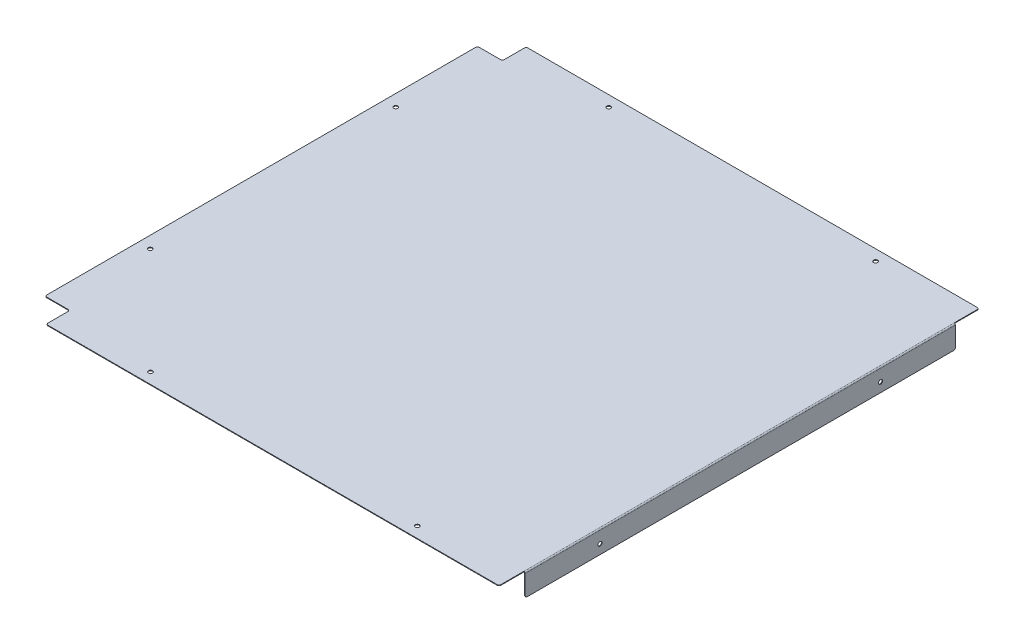
ISO-10303-21;
HEADER;
FILE_DESCRIPTION(('STEP AP214'),'2;1');
FILE_NAME('part.step','',(''),(''),'','','');
FILE_SCHEMA(('AUTOMOTIVE_DESIGN { 1 0 10303 214 1 1 1 1 }'));
ENDSEC;
DATA;
#1=APPLICATION_CONTEXT('core data for automotive mechanical design processes');
#2=APPLICATION_PROTOCOL_DEFINITION('international standard','automotive_design',2000,#1);
#3=PRODUCT_CONTEXT('',#1,'mechanical');
#4=PRODUCT('Part','Part','',(#3));
#5=PRODUCT_RELATED_PRODUCT_CATEGORY('part','',(#4));
#6=PRODUCT_DEFINITION_FORMATION('','',#4);
#7=PRODUCT_DEFINITION_CONTEXT('part definition',#1,'design');
#8=PRODUCT_DEFINITION('design','',#6,#7);
#9=PRODUCT_DEFINITION_SHAPE('','',#8);
#10=(LENGTH_UNIT() NAMED_UNIT(*) SI_UNIT(.MILLI.,.METRE.));
#11=(NAMED_UNIT(*) PLANE_ANGLE_UNIT() SI_UNIT($,.RADIAN.));
#12=(NAMED_UNIT(*) SI_UNIT($,.STERADIAN.) SOLID_ANGLE_UNIT());
#13=UNCERTAINTY_MEASURE_WITH_UNIT(LENGTH_MEASURE(1.E-05),#10,'distance_accuracy_value','');
#14=(GEOMETRIC_REPRESENTATION_CONTEXT(3) GLOBAL_UNCERTAINTY_ASSIGNED_CONTEXT((#13)) GLOBAL_UNIT_ASSIGNED_CONTEXT((#10,
#11,#12)) REPRESENTATION_CONTEXT('',''));
#15=CARTESIAN_POINT('',(0.,0.,0.));
#16=DIRECTION('',(0.,0.,1.));
#17=DIRECTION('',(1.,0.,0.));
#18=AXIS2_PLACEMENT_3D('',#15,#16,#17);
#19=CARTESIAN_POINT('',(362.5,0.,-403.582250064176));
#20=DIRECTION('',(-1.,0.,0.));
#21=DIRECTION('',(0.,0.,1.));
#22=AXIS2_PLACEMENT_3D('',#19,#20,#21);
#23=PLANE('',#22);
#24=DIRECTION('',(0.,0.,1.));
#25=VECTOR('',#24,1.);
#26=CARTESIAN_POINT('',(362.5,0.,0.));
#27=LINE('',#26,#25);
#28=CARTESIAN_POINT('',(362.5,0.,-382.));
#29=VERTEX_POINT('',#28);
#30=CARTESIAN_POINT('',(362.5,0.,-345.));
#31=VERTEX_POINT('',#30);
#32=EDGE_CURVE('E365',#29,#31,#27,.T.);
#33=ORIENTED_EDGE('',*,*,#32,.F.);
#34=DIRECTION('',(0.,-1.,0.));
#35=VECTOR('',#34,1.);
#36=CARTESIAN_POINT('',(362.5,1.,-382.));
#37=LINE('',#36,#35);
#38=CARTESIAN_POINT('',(362.5,1.,-382.));
#39=VERTEX_POINT('',#38);
#40=EDGE_CURVE('E384',#29,#39,#37,.F.);
#41=ORIENTED_EDGE('',*,*,#40,.T.);
#42=DIRECTION('',(0.,0.,1.));
#43=VECTOR('',#42,1.);
#44=CARTESIAN_POINT('',(362.5,1.,-403.582250064176));
#45=LINE('',#44,#43);
#46=CARTESIAN_POINT('',(362.5,1.00000000000001,-345.));
#47=VERTEX_POINT('',#46);
#48=EDGE_CURVE('E286',#39,#47,#45,.T.);
#49=ORIENTED_EDGE('',*,*,#48,.T.);
#50=DIRECTION('',(0.,1.,0.));
#51=VECTOR('',#50,1.);
#52=CARTESIAN_POINT('',(362.5,0.,-345.));
#53=LINE('',#52,#51);
#54=EDGE_CURVE('E281',#31,#47,#53,.T.);
#55=ORIENTED_EDGE('',*,*,#54,.F.);
#56=EDGE_LOOP('',(#33,#41,#49,#55));
#57=FACE_BOUND('',#56,.T.);
#58=ADVANCED_FACE('F59',(#57),#23,.F.);
#59=CARTESIAN_POINT('',(0.,1.,-385.));
#60=DIRECTION('',(0.,0.,1.));
#61=DIRECTION('',(1.,0.,0.));
#62=AXIS2_PLACEMENT_3D('',#59,#60,#61);
#63=PLANE('',#62);
#64=DIRECTION('',(1.,0.,0.));
#65=VECTOR('',#64,1.);
#66=CARTESIAN_POINT('',(0.,1.,-385.));
#67=LINE('',#66,#65);
#68=CARTESIAN_POINT('',(-361.,1.,-385.));
#69=VERTEX_POINT('',#68);
#70=CARTESIAN_POINT('',(359.5,1.,-385.));
#71=VERTEX_POINT('',#70);
#72=EDGE_CURVE('E314',#69,#71,#67,.T.);
#73=ORIENTED_EDGE('',*,*,#72,.T.);
#74=DIRECTION('',(0.,1.,0.));
#75=VECTOR('',#74,1.);
#76=CARTESIAN_POINT('',(359.5,0.,-385.));
#77=LINE('',#76,#75);
#78=CARTESIAN_POINT('',(359.5,0.,-385.));
#79=VERTEX_POINT('',#78);
#80=EDGE_CURVE('E402',#71,#79,#77,.F.);
#81=ORIENTED_EDGE('',*,*,#80,.T.);
#82=DIRECTION('',(1.,0.,0.));
#83=VECTOR('',#82,1.);
#84=CARTESIAN_POINT('',(0.,0.,-385.));
#85=LINE('',#84,#83);
#86=CARTESIAN_POINT('',(-361.,0.,-385.));
#87=VERTEX_POINT('',#86);
#88=EDGE_CURVE('E360',#87,#79,#85,.T.);
#89=ORIENTED_EDGE('',*,*,#88,.F.);
#90=DIRECTION('',(0.,1.,0.));
#91=VECTOR('',#90,1.);
#92=CARTESIAN_POINT('',(-361.,1.,-385.));
#93=LINE('',#92,#91);
#94=EDGE_CURVE('E399',#87,#69,#93,.T.);
#95=ORIENTED_EDGE('',*,*,#94,.T.);
#96=EDGE_LOOP('',(#73,#81,#89,#95));
#97=FACE_BOUND('',#96,.T.);
#98=ADVANCED_FACE('F499',(#97),#63,.F.);
#99=CARTESIAN_POINT('',(-364.,1.,5.3008102957558E-13));
#100=DIRECTION('',(-1.,0.,0.));
#101=DIRECTION('',(0.,0.,1.));
#102=AXIS2_PLACEMENT_3D('',#99,#100,#101);
#103=PLANE('',#102);
#104=DIRECTION('',(0.,0.,1.));
#105=VECTOR('',#104,1.);
#106=CARTESIAN_POINT('',(-364.,1.,5.3008102957558E-13));
#107=LINE('',#106,#105);
#108=CARTESIAN_POINT('',(-364.,1.,-382.));
#109=VERTEX_POINT('',#108);
#110=CARTESIAN_POINT('',(-364.,1.,-349.881188118812));
#111=VERTEX_POINT('',#110);
#112=EDGE_CURVE('E317',#109,#111,#107,.T.);
#113=ORIENTED_EDGE('',*,*,#112,.F.);
#114=DIRECTION('',(0.,-1.,0.));
#115=VECTOR('',#114,1.);
#116=CARTESIAN_POINT('',(-364.,1.,-382.));
#117=LINE('',#116,#115);
#118=CARTESIAN_POINT('',(-364.,0.,-382.));
#119=VERTEX_POINT('',#118);
#120=EDGE_CURVE('E82',#109,#119,#117,.T.);
#121=ORIENTED_EDGE('',*,*,#120,.T.);
#122=DIRECTION('',(0.,0.,1.));
#123=VECTOR('',#122,1.);
#124=CARTESIAN_POINT('',(-364.,0.,0.));
#125=LINE('',#124,#123);
#126=CARTESIAN_POINT('',(-364.,0.,-349.881188118812));
#127=VERTEX_POINT('',#126);
#128=EDGE_CURVE('E358',#119,#127,#125,.T.);
#129=ORIENTED_EDGE('',*,*,#128,.T.);
#130=DIRECTION('',(0.,-1.,0.));
#131=VECTOR('',#130,1.);
#132=CARTESIAN_POINT('',(-364.,1.,-349.881188118812));
#133=LINE('',#132,#131);
#134=EDGE_CURVE('E416',#127,#111,#133,.F.);
#135=ORIENTED_EDGE('',*,*,#134,.T.);
#136=EDGE_LOOP('',(#113,#121,#129,#135));
#137=FACE_BOUND('',#136,.T.);
#138=ADVANCED_FACE('F491',(#137),#103,.T.);
#139=CARTESIAN_POINT('',(0.,1.,-346.881188118812));
#140=DIRECTION('',(0.,0.,1.));
#141=DIRECTION('',(1.,0.,0.));
#142=AXIS2_PLACEMENT_3D('',#139,#140,#141);
#143=PLANE('',#142);
#144=DIRECTION('',(1.,0.,0.));
#145=VECTOR('',#144,1.);
#146=CARTESIAN_POINT('',(0.,1.,-346.881188118812));
#147=LINE('',#146,#145);
#148=CARTESIAN_POINT('',(-401.,1.,-346.881188118812));
#149=VERTEX_POINT('',#148);
#150=CARTESIAN_POINT('',(-367.,1.,-346.881188118812));
#151=VERTEX_POINT('',#150);
#152=EDGE_CURVE('E320',#149,#151,#147,.T.);
#153=ORIENTED_EDGE('',*,*,#152,.T.);
#154=DIRECTION('',(0.,1.,0.));
#155=VECTOR('',#154,1.);
#156=CARTESIAN_POINT('',(-367.,0.,-346.881188118812));
#157=LINE('',#156,#155);
#158=CARTESIAN_POINT('',(-367.,0.,-346.881188118812));
#159=VERTEX_POINT('',#158);
#160=EDGE_CURVE('E423',#151,#159,#157,.F.);
#161=ORIENTED_EDGE('',*,*,#160,.T.);
#162=DIRECTION('',(1.,0.,0.));
#163=VECTOR('',#162,1.);
#164=CARTESIAN_POINT('',(0.,0.,-346.881188118812));
#165=LINE('',#164,#163);
#166=CARTESIAN_POINT('',(-401.,0.,-346.881188118812));
#167=VERTEX_POINT('',#166);
#168=EDGE_CURVE('E356',#167,#159,#165,.T.);
#169=ORIENTED_EDGE('',*,*,#168,.F.);
#170=DIRECTION('',(0.,-1.,0.));
#171=VECTOR('',#170,1.);
#172=CARTESIAN_POINT('',(-401.,1.,-346.881188118812));
#173=LINE('',#172,#171);
#174=EDGE_CURVE('E420',#167,#149,#173,.F.);
#175=ORIENTED_EDGE('',*,*,#174,.T.);
#176=EDGE_LOOP('',(#153,#161,#169,#175));
#177=FACE_BOUND('',#176,.T.);
#178=ADVANCED_FACE('F485',(#177),#143,.F.);
#179=CARTESIAN_POINT('',(-404.,1.,0.));
#180=DIRECTION('',(1.,0.,0.));
#181=DIRECTION('',(0.,0.,-1.));
#182=AXIS2_PLACEMENT_3D('',#179,#180,#181);
#183=PLANE('',#182);
#184=DIRECTION('',(0.,0.,-1.));
#185=VECTOR('',#184,1.);
#186=CARTESIAN_POINT('',(-404.,1.,0.));
#187=LINE('',#186,#185);
#188=CARTESIAN_POINT('',(-404.,1.,343.881188118812));
#189=VERTEX_POINT('',#188);
#190=CARTESIAN_POINT('',(-404.,1.,-343.881188118812));
#191=VERTEX_POINT('',#190);
#192=EDGE_CURVE('E323',#189,#191,#187,.T.);
#193=ORIENTED_EDGE('',*,*,#192,.T.);
#194=DIRECTION('',(0.,-1.,0.));
#195=VECTOR('',#194,1.);
#196=CARTESIAN_POINT('',(-404.,1.,-343.881188118812));
#197=LINE('',#196,#195);
#198=CARTESIAN_POINT('',(-404.,0.,-343.881188118812));
#199=VERTEX_POINT('',#198);
#200=EDGE_CURVE('E428',#191,#199,#197,.T.);
#201=ORIENTED_EDGE('',*,*,#200,.T.);
#202=DIRECTION('',(0.,0.,1.));
#203=VECTOR('',#202,1.);
#204=CARTESIAN_POINT('',(-404.,0.,0.));
#205=LINE('',#204,#203);
#206=CARTESIAN_POINT('',(-404.,0.,343.881188118812));
#207=VERTEX_POINT('',#206);
#208=EDGE_CURVE('E353',#207,#199,#205,.F.);
#209=ORIENTED_EDGE('',*,*,#208,.F.);
#210=DIRECTION('',(0.,1.,0.));
#211=VECTOR('',#210,1.);
#212=CARTESIAN_POINT('',(-404.,1.,343.881188118812));
#213=LINE('',#212,#211);
#214=EDGE_CURVE('E425',#207,#189,#213,.T.);
#215=ORIENTED_EDGE('',*,*,#214,.T.);
#216=EDGE_LOOP('',(#193,#201,#209,#215));
#217=FACE_BOUND('',#216,.T.);
#218=ADVANCED_FACE('F477',(#217),#183,.F.);
#219=CARTESIAN_POINT('',(0.,1.,346.881188118812));
#220=DIRECTION('',(0.,0.,1.));
#221=DIRECTION('',(1.,0.,0.));
#222=AXIS2_PLACEMENT_3D('',#219,#220,#221);
#223=PLANE('',#222);
#224=DIRECTION('',(1.,0.,0.));
#225=VECTOR('',#224,1.);
#226=CARTESIAN_POINT('',(0.,1.,346.881188118812));
#227=LINE('',#226,#225);
#228=CARTESIAN_POINT('',(-401.,1.,346.881188118812));
#229=VERTEX_POINT('',#228);
#230=CARTESIAN_POINT('',(-367.,1.,346.881188118812));
#231=VERTEX_POINT('',#230);
#232=EDGE_CURVE('E326',#229,#231,#227,.T.);
#233=ORIENTED_EDGE('',*,*,#232,.F.);
#234=DIRECTION('',(0.,-1.,0.));
#235=VECTOR('',#234,1.);
#236=CARTESIAN_POINT('',(-401.,1.,346.881188118812));
#237=LINE('',#236,#235);
#238=CARTESIAN_POINT('',(-401.,0.,346.881188118812));
#239=VERTEX_POINT('',#238);
#240=EDGE_CURVE('E433',#229,#239,#237,.T.);
#241=ORIENTED_EDGE('',*,*,#240,.T.);
#242=DIRECTION('',(1.,0.,0.));
#243=VECTOR('',#242,1.);
#244=CARTESIAN_POINT('',(0.,0.,346.881188118812));
#245=LINE('',#244,#243);
#246=CARTESIAN_POINT('',(-367.,0.,346.881188118812));
#247=VERTEX_POINT('',#246);
#248=EDGE_CURVE('E293',#239,#247,#245,.T.);
#249=ORIENTED_EDGE('',*,*,#248,.T.);
#250=DIRECTION('',(0.,-1.,0.));
#251=VECTOR('',#250,1.);
#252=CARTESIAN_POINT('',(-367.,1.,346.881188118812));
#253=LINE('',#252,#251);
#254=EDGE_CURVE('E430',#247,#231,#253,.F.);
#255=ORIENTED_EDGE('',*,*,#254,.T.);
#256=EDGE_LOOP('',(#233,#241,#249,#255));
#257=FACE_BOUND('',#256,.T.);
#258=ADVANCED_FACE('F469',(#257),#223,.T.);
#259=CARTESIAN_POINT('',(-364.,1.,-5.3008102957558E-13));
#260=DIRECTION('',(1.,0.,0.));
#261=DIRECTION('',(0.,0.,-1.));
#262=AXIS2_PLACEMENT_3D('',#259,#260,#261);
#263=PLANE('',#262);
#264=DIRECTION('',(0.,0.,-1.));
#265=VECTOR('',#264,1.);
#266=CARTESIAN_POINT('',(-364.,1.,-5.3008102957558E-13));
#267=LINE('',#266,#265);
#268=CARTESIAN_POINT('',(-364.,1.,382.));
#269=VERTEX_POINT('',#268);
#270=CARTESIAN_POINT('',(-364.,1.,349.881188118812));
#271=VERTEX_POINT('',#270);
#272=EDGE_CURVE('E308',#269,#271,#267,.T.);
#273=ORIENTED_EDGE('',*,*,#272,.T.);
#274=DIRECTION('',(0.,1.,0.));
#275=VECTOR('',#274,1.);
#276=CARTESIAN_POINT('',(-364.,0.,349.881188118812));
#277=LINE('',#276,#275);
#278=CARTESIAN_POINT('',(-364.,0.,349.881188118812));
#279=VERTEX_POINT('',#278);
#280=EDGE_CURVE('E438',#271,#279,#277,.F.);
#281=ORIENTED_EDGE('',*,*,#280,.T.);
#282=DIRECTION('',(0.,0.,1.));
#283=VECTOR('',#282,1.);
#284=CARTESIAN_POINT('',(-364.,0.,0.));
#285=LINE('',#284,#283);
#286=CARTESIAN_POINT('',(-364.,0.,382.));
#287=VERTEX_POINT('',#286);
#288=EDGE_CURVE('E347',#287,#279,#285,.F.);
#289=ORIENTED_EDGE('',*,*,#288,.F.);
#290=DIRECTION('',(0.,1.,0.));
#291=VECTOR('',#290,1.);
#292=CARTESIAN_POINT('',(-364.,1.,382.));
#293=LINE('',#292,#291);
#294=EDGE_CURVE('E435',#287,#269,#293,.T.);
#295=ORIENTED_EDGE('',*,*,#294,.T.);
#296=EDGE_LOOP('',(#273,#281,#289,#295));
#297=FACE_BOUND('',#296,.T.);
#298=ADVANCED_FACE('F460',(#297),#263,.F.);
#299=CARTESIAN_POINT('',(-214.,1.,367.5));
#300=DIRECTION('',(0.,1.,0.));
#301=DIRECTION('',(0.,0.,1.));
#302=AXIS2_PLACEMENT_3D('',#299,#300,#301);
#303=CYLINDRICAL_SURFACE('',#302,3.3);
#304=CARTESIAN_POINT('',(-214.,1.,367.5));
#305=DIRECTION('',(0.,1.,0.));
#306=DIRECTION('',(0.,0.,1.));
#307=AXIS2_PLACEMENT_3D('',#304,#305,#306);
#308=CIRCLE('',#307,3.3);
#309=CARTESIAN_POINT('',(-214.,1.,370.8));
#310=VERTEX_POINT('',#309);
#311=EDGE_CURVE('E289',#310,#310,#308,.T.);
#312=ORIENTED_EDGE('',*,*,#311,.T.);
#313=EDGE_LOOP('',(#312));
#314=FACE_BOUND('',#313,.T.);
#315=CARTESIAN_POINT('',(-214.,0.,367.5));
#316=DIRECTION('',(0.,1.,0.));
#317=DIRECTION('',(0.,0.,1.));
#318=AXIS2_PLACEMENT_3D('',#315,#316,#317);
#319=CIRCLE('',#318,3.3);
#320=CARTESIAN_POINT('',(-214.,0.,370.8));
#321=VERTEX_POINT('',#320);
#322=EDGE_CURVE('E288',#321,#321,#319,.T.);
#323=ORIENTED_EDGE('',*,*,#322,.F.);
#324=EDGE_LOOP('',(#323));
#325=FACE_BOUND('',#324,.T.);
#326=ADVANCED_FACE('F557',(#314,#325),#303,.F.);
#327=CARTESIAN_POINT('',(-385.,1.,196.881188118812));
#328=DIRECTION('',(0.,1.,0.));
#329=DIRECTION('',(0.,0.,1.));
#330=AXIS2_PLACEMENT_3D('',#327,#328,#329);
#331=CYLINDRICAL_SURFACE('',#330,3.29999999999997);
#332=CARTESIAN_POINT('',(-385.,1.,196.881188118812));
#333=DIRECTION('',(0.,1.,0.));
#334=DIRECTION('',(0.,0.,1.));
#335=AXIS2_PLACEMENT_3D('',#332,#333,#334);
#336=CIRCLE('',#335,3.29999999999997);
#337=CARTESIAN_POINT('',(-385.,1.,200.181188118812));
#338=VERTEX_POINT('',#337);
#339=EDGE_CURVE('E292',#338,#338,#336,.T.);
#340=ORIENTED_EDGE('',*,*,#339,.T.);
#341=EDGE_LOOP('',(#340));
#342=FACE_BOUND('',#341,.T.);
#343=CARTESIAN_POINT('',(-385.,0.,196.881188118812));
#344=DIRECTION('',(0.,1.,0.));
#345=DIRECTION('',(0.,0.,1.));
#346=AXIS2_PLACEMENT_3D('',#343,#344,#345);
#347=CIRCLE('',#346,3.29999999999997);
#348=CARTESIAN_POINT('',(-385.,0.,200.181188118812));
#349=VERTEX_POINT('',#348);
#350=EDGE_CURVE('E332',#349,#349,#347,.T.);
#351=ORIENTED_EDGE('',*,*,#350,.F.);
#352=EDGE_LOOP('',(#351));
#353=FACE_BOUND('',#352,.T.);
#354=ADVANCED_FACE('F560',(#342,#353),#331,.F.);
#355=CARTESIAN_POINT('',(-385.,1.,-196.881188118812));
#356=DIRECTION('',(0.,1.,0.));
#357=DIRECTION('',(0.,0.,1.));
#358=AXIS2_PLACEMENT_3D('',#355,#356,#357);
#359=CYLINDRICAL_SURFACE('',#358,3.29999999999997);
#360=CARTESIAN_POINT('',(-385.,1.,-196.881188118812));
#361=DIRECTION('',(0.,1.,0.));
#362=DIRECTION('',(0.,0.,1.));
#363=AXIS2_PLACEMENT_3D('',#360,#361,#362);
#364=CIRCLE('',#363,3.29999999999997);
#365=CARTESIAN_POINT('',(-385.,1.,-193.581188118812));
#366=VERTEX_POINT('',#365);
#367=EDGE_CURVE('E296',#366,#366,#364,.T.);
#368=ORIENTED_EDGE('',*,*,#367,.T.);
#369=EDGE_LOOP('',(#368));
#370=FACE_BOUND('',#369,.T.);
#371=CARTESIAN_POINT('',(-385.,0.,-196.881188118812));
#372=DIRECTION('',(0.,1.,0.));
#373=DIRECTION('',(0.,0.,1.));
#374=AXIS2_PLACEMENT_3D('',#371,#372,#373);
#375=CIRCLE('',#374,3.29999999999997);
#376=CARTESIAN_POINT('',(-385.,0.,-193.581188118812));
#377=VERTEX_POINT('',#376);
#378=EDGE_CURVE('E335',#377,#377,#375,.T.);
#379=ORIENTED_EDGE('',*,*,#378,.F.);
#380=EDGE_LOOP('',(#379));
#381=FACE_BOUND('',#380,.T.);
#382=ADVANCED_FACE('F564',(#370,#381),#359,.F.);
#383=CARTESIAN_POINT('',(-214.,1.,-367.5));
#384=DIRECTION('',(0.,1.,0.));
#385=DIRECTION('',(0.,0.,1.));
#386=AXIS2_PLACEMENT_3D('',#383,#384,#385);
#387=CYLINDRICAL_SURFACE('',#386,3.3);
#388=CARTESIAN_POINT('',(-214.,1.,-367.5));
#389=DIRECTION('',(0.,1.,0.));
#390=DIRECTION('',(0.,0.,1.));
#391=AXIS2_PLACEMENT_3D('',#388,#389,#390);
#392=CIRCLE('',#391,3.3);
#393=CARTESIAN_POINT('',(-214.,1.,-364.2));
#394=VERTEX_POINT('',#393);
#395=EDGE_CURVE('E299',#394,#394,#392,.T.);
#396=ORIENTED_EDGE('',*,*,#395,.T.);
#397=EDGE_LOOP('',(#396));
#398=FACE_BOUND('',#397,.T.);
#399=CARTESIAN_POINT('',(-214.,0.,-367.5));
#400=DIRECTION('',(0.,1.,0.));
#401=DIRECTION('',(0.,0.,1.));
#402=AXIS2_PLACEMENT_3D('',#399,#400,#401);
#403=CIRCLE('',#402,3.3);
#404=CARTESIAN_POINT('',(-214.,0.,-364.2));
#405=VERTEX_POINT('',#404);
#406=EDGE_CURVE('E338',#405,#405,#403,.T.);
#407=ORIENTED_EDGE('',*,*,#406,.F.);
#408=EDGE_LOOP('',(#407));
#409=FACE_BOUND('',#408,.T.);
#410=ADVANCED_FACE('F568',(#398,#409),#387,.F.);
#411=CARTESIAN_POINT('',(214.,1.,-367.5));
#412=DIRECTION('',(0.,1.,0.));
#413=DIRECTION('',(0.,0.,1.));
#414=AXIS2_PLACEMENT_3D('',#411,#412,#413);
#415=CYLINDRICAL_SURFACE('',#414,3.3);
#416=CARTESIAN_POINT('',(214.,1.,-367.5));
#417=DIRECTION('',(0.,1.,0.));
#418=DIRECTION('',(0.,0.,1.));
#419=AXIS2_PLACEMENT_3D('',#416,#417,#418);
#420=CIRCLE('',#419,3.3);
#421=CARTESIAN_POINT('',(214.,1.,-364.2));
#422=VERTEX_POINT('',#421);
#423=EDGE_CURVE('E302',#422,#422,#420,.T.);
#424=ORIENTED_EDGE('',*,*,#423,.T.);
#425=EDGE_LOOP('',(#424));
#426=FACE_BOUND('',#425,.T.);
#427=CARTESIAN_POINT('',(214.,0.,-367.5));
#428=DIRECTION('',(0.,1.,0.));
#429=DIRECTION('',(0.,0.,1.));
#430=AXIS2_PLACEMENT_3D('',#427,#428,#429);
#431=CIRCLE('',#430,3.3);
#432=CARTESIAN_POINT('',(214.,0.,-364.2));
#433=VERTEX_POINT('',#432);
#434=EDGE_CURVE('E341',#433,#433,#431,.T.);
#435=ORIENTED_EDGE('',*,*,#434,.F.);
#436=EDGE_LOOP('',(#435));
#437=FACE_BOUND('',#436,.T.);
#438=ADVANCED_FACE('F572',(#426,#437),#415,.F.);
#439=CARTESIAN_POINT('',(214.,1.,367.5));
#440=DIRECTION('',(0.,1.,0.));
#441=DIRECTION('',(0.,0.,1.));
#442=AXIS2_PLACEMENT_3D('',#439,#440,#441);
#443=CYLINDRICAL_SURFACE('',#442,3.3);
#444=CARTESIAN_POINT('',(214.,1.,367.5));
#445=DIRECTION('',(0.,1.,0.));
#446=DIRECTION('',(0.,0.,1.));
#447=AXIS2_PLACEMENT_3D('',#444,#445,#446);
#448=CIRCLE('',#447,3.3);
#449=CARTESIAN_POINT('',(214.,1.,370.8));
#450=VERTEX_POINT('',#449);
#451=EDGE_CURVE('E305',#450,#450,#448,.T.);
#452=ORIENTED_EDGE('',*,*,#451,.T.);
#453=EDGE_LOOP('',(#452));
#454=FACE_BOUND('',#453,.T.);
#455=CARTESIAN_POINT('',(214.,0.,367.5));
#456=DIRECTION('',(0.,1.,0.));
#457=DIRECTION('',(0.,0.,1.));
#458=AXIS2_PLACEMENT_3D('',#455,#456,#457);
#459=CIRCLE('',#458,3.3);
#460=CARTESIAN_POINT('',(214.,0.,370.8));
#461=VERTEX_POINT('',#460);
#462=EDGE_CURVE('E344',#461,#461,#459,.T.);
#463=ORIENTED_EDGE('',*,*,#462,.F.);
#464=EDGE_LOOP('',(#463));
#465=FACE_BOUND('',#464,.T.);
#466=ADVANCED_FACE('F576',(#454,#465),#443,.F.);
#467=CARTESIAN_POINT('',(0.,1.,385.));
#468=DIRECTION('',(0.,0.,1.));
#469=DIRECTION('',(1.,0.,0.));
#470=AXIS2_PLACEMENT_3D('',#467,#468,#469);
#471=PLANE('',#470);
#472=DIRECTION('',(1.,0.,0.));
#473=VECTOR('',#472,1.);
#474=CARTESIAN_POINT('',(0.,1.,385.));
#475=LINE('',#474,#473);
#476=CARTESIAN_POINT('',(-361.,1.,385.));
#477=VERTEX_POINT('',#476);
#478=CARTESIAN_POINT('',(359.5,1.,385.));
#479=VERTEX_POINT('',#478);
#480=EDGE_CURVE('E311',#477,#479,#475,.T.);
#481=ORIENTED_EDGE('',*,*,#480,.F.);
#482=DIRECTION('',(0.,-1.,0.));
#483=VECTOR('',#482,1.);
#484=CARTESIAN_POINT('',(-361.,1.,385.));
#485=LINE('',#484,#483);
#486=CARTESIAN_POINT('',(-361.,0.,385.));
#487=VERTEX_POINT('',#486);
#488=EDGE_CURVE('E442',#477,#487,#485,.T.);
#489=ORIENTED_EDGE('',*,*,#488,.T.);
#490=DIRECTION('',(1.,0.,0.));
#491=VECTOR('',#490,1.);
#492=CARTESIAN_POINT('',(0.,0.,385.));
#493=LINE('',#492,#491);
#494=CARTESIAN_POINT('',(359.5,0.,385.));
#495=VERTEX_POINT('',#494);
#496=EDGE_CURVE('E350',#487,#495,#493,.T.);
#497=ORIENTED_EDGE('',*,*,#496,.T.);
#498=DIRECTION('',(0.,-1.,0.));
#499=VECTOR('',#498,1.);
#500=CARTESIAN_POINT('',(359.5,1.,385.));
#501=LINE('',#500,#499);
#502=EDGE_CURVE('E440',#495,#479,#501,.F.);
#503=ORIENTED_EDGE('',*,*,#502,.T.);
#504=EDGE_LOOP('',(#481,#489,#497,#503));
#505=FACE_BOUND('',#504,.T.);
#506=ADVANCED_FACE('F523',(#505),#471,.T.);
#507=CARTESIAN_POINT('',(0.,1.,0.));
#508=DIRECTION('',(0.,1.,0.));
#509=DIRECTION('',(0.,0.,1.));
#510=AXIS2_PLACEMENT_3D('',#507,#508,#509);
#511=PLANE('',#510);
#512=ORIENTED_EDGE('',*,*,#48,.F.);
#513=CARTESIAN_POINT('',(359.5,1.,-382.));
#514=DIRECTION('',(0.,1.,0.));
#515=DIRECTION('',(0.,0.,1.));
#516=AXIS2_PLACEMENT_3D('',#513,#514,#515);
#517=CIRCLE('',#516,3.);
#518=EDGE_CURVE('E397',#39,#71,#517,.T.);
#519=ORIENTED_EDGE('',*,*,#518,.T.);
#520=ORIENTED_EDGE('',*,*,#72,.F.);
#521=CARTESIAN_POINT('',(-361.,1.,-382.));
#522=DIRECTION('',(0.,1.,0.));
#523=DIRECTION('',(0.,0.,1.));
#524=AXIS2_PLACEMENT_3D('',#521,#522,#523);
#525=CIRCLE('',#524,3.);
#526=EDGE_CURVE('E395',#69,#109,#525,.T.);
#527=ORIENTED_EDGE('',*,*,#526,.T.);
#528=ORIENTED_EDGE('',*,*,#112,.T.);
#529=CARTESIAN_POINT('',(-367.,1.,-349.881188118812));
#530=DIRECTION('',(0.,1.,0.));
#531=DIRECTION('',(0.,0.,1.));
#532=AXIS2_PLACEMENT_3D('',#529,#530,#531);
#533=CIRCLE('',#532,3.);
#534=EDGE_CURVE('E447',#111,#151,#533,.F.);
#535=ORIENTED_EDGE('',*,*,#534,.T.);
#536=ORIENTED_EDGE('',*,*,#152,.F.);
#537=CARTESIAN_POINT('',(-401.,1.,-343.881188118812));
#538=DIRECTION('',(0.,1.,0.));
#539=DIRECTION('',(0.,0.,1.));
#540=AXIS2_PLACEMENT_3D('',#537,#538,#539);
#541=CIRCLE('',#540,3.);
#542=EDGE_CURVE('E393',#149,#191,#541,.T.);
#543=ORIENTED_EDGE('',*,*,#542,.T.);
#544=ORIENTED_EDGE('',*,*,#192,.F.);
#545=CARTESIAN_POINT('',(-401.,1.,343.881188118812));
#546=DIRECTION('',(0.,1.,0.));
#547=DIRECTION('',(0.,0.,1.));
#548=AXIS2_PLACEMENT_3D('',#545,#546,#547);
#549=CIRCLE('',#548,3.);
#550=EDGE_CURVE('E391',#189,#229,#549,.T.);
#551=ORIENTED_EDGE('',*,*,#550,.T.);
#552=ORIENTED_EDGE('',*,*,#232,.T.);
#553=CARTESIAN_POINT('',(-367.,1.,349.881188118812));
#554=DIRECTION('',(0.,1.,0.));
#555=DIRECTION('',(0.,0.,1.));
#556=AXIS2_PLACEMENT_3D('',#553,#554,#555);
#557=CIRCLE('',#556,3.);
#558=EDGE_CURVE('E68',#231,#271,#557,.F.);
#559=ORIENTED_EDGE('',*,*,#558,.T.);
#560=ORIENTED_EDGE('',*,*,#272,.F.);
#561=CARTESIAN_POINT('',(-361.,1.,382.));
#562=DIRECTION('',(0.,1.,0.));
#563=DIRECTION('',(0.,0.,1.));
#564=AXIS2_PLACEMENT_3D('',#561,#562,#563);
#565=CIRCLE('',#564,3.);
#566=EDGE_CURVE('E389',#269,#477,#565,.T.);
#567=ORIENTED_EDGE('',*,*,#566,.T.);
#568=ORIENTED_EDGE('',*,*,#480,.T.);
#569=CARTESIAN_POINT('',(359.5,1.,382.));
#570=DIRECTION('',(0.,1.,0.));
#571=DIRECTION('',(0.,0.,1.));
#572=AXIS2_PLACEMENT_3D('',#569,#570,#571);
#573=CIRCLE('',#572,3.);
#574=CARTESIAN_POINT('',(362.5,1.,382.));
#575=VERTEX_POINT('',#574);
#576=EDGE_CURVE('E387',#479,#575,#573,.T.);
#577=ORIENTED_EDGE('',*,*,#576,.T.);
#578=CARTESIAN_POINT('',(362.5,1.,345.012501953735));
#579=VERTEX_POINT('',#578);
#580=EDGE_CURVE('E284',#579,#575,#45,.T.);
#581=ORIENTED_EDGE('',*,*,#580,.F.);
#582=DIRECTION('',(0.,0.,1.));
#583=VECTOR('',#582,1.);
#584=CARTESIAN_POINT('',(362.5,1.00000000000015,345.012501953736));
#585=LINE('',#584,#583);
#586=EDGE_CURVE('E244',#579,#47,#585,.F.);
#587=ORIENTED_EDGE('',*,*,#586,.T.);
#588=EDGE_LOOP('',(#512,#519,#520,#527,#528,#535,#536,#543,#544,#551,#552,#559,#560,#567,#568,
#577,#581,#587));
#589=FACE_BOUND('',#588,.T.);
#590=ORIENTED_EDGE('',*,*,#311,.F.);
#591=EDGE_LOOP('',(#590));
#592=FACE_BOUND('',#591,.T.);
#593=ORIENTED_EDGE('',*,*,#339,.F.);
#594=EDGE_LOOP('',(#593));
#595=FACE_BOUND('',#594,.T.);
#596=ORIENTED_EDGE('',*,*,#367,.F.);
#597=EDGE_LOOP('',(#596));
#598=FACE_BOUND('',#597,.T.);
#599=ORIENTED_EDGE('',*,*,#395,.F.);
#600=EDGE_LOOP('',(#599));
#601=FACE_BOUND('',#600,.T.);
#602=ORIENTED_EDGE('',*,*,#423,.F.);
#603=EDGE_LOOP('',(#602));
#604=FACE_BOUND('',#603,.T.);
#605=ORIENTED_EDGE('',*,*,#451,.F.);
#606=EDGE_LOOP('',(#605));
#607=FACE_BOUND('',#606,.T.);
#608=ADVANCED_FACE('F453',(#589,#592,#595,#598,#601,#604,#607),#511,.T.);
#609=CARTESIAN_POINT('',(0.,0.,0.));
#610=DIRECTION('',(0.,1.,0.));
#611=DIRECTION('',(0.,0.,1.));
#612=AXIS2_PLACEMENT_3D('',#609,#610,#611);
#613=PLANE('',#612);
#614=ORIENTED_EDGE('',*,*,#322,.T.);
#615=EDGE_LOOP('',(#614));
#616=FACE_BOUND('',#615,.T.);
#617=ORIENTED_EDGE('',*,*,#350,.T.);
#618=EDGE_LOOP('',(#617));
#619=FACE_BOUND('',#618,.T.);
#620=ORIENTED_EDGE('',*,*,#378,.T.);
#621=EDGE_LOOP('',(#620));
#622=FACE_BOUND('',#621,.T.);
#623=ORIENTED_EDGE('',*,*,#406,.T.);
#624=EDGE_LOOP('',(#623));
#625=FACE_BOUND('',#624,.T.);
#626=ORIENTED_EDGE('',*,*,#434,.T.);
#627=EDGE_LOOP('',(#626));
#628=FACE_BOUND('',#627,.T.);
#629=ORIENTED_EDGE('',*,*,#462,.T.);
#630=EDGE_LOOP('',(#629));
#631=FACE_BOUND('',#630,.T.);
#632=ORIENTED_EDGE('',*,*,#88,.T.);
#633=CARTESIAN_POINT('',(359.5,0.,-382.));
#634=DIRECTION('',(0.,1.,0.));
#635=DIRECTION('',(0.,0.,1.));
#636=AXIS2_PLACEMENT_3D('',#633,#634,#635);
#637=CIRCLE('',#636,3.);
#638=EDGE_CURVE('E414',#79,#29,#637,.F.);
#639=ORIENTED_EDGE('',*,*,#638,.T.);
#640=ORIENTED_EDGE('',*,*,#32,.T.);
#641=DIRECTION('',(0.,0.,1.));
#642=VECTOR('',#641,1.);
#643=CARTESIAN_POINT('',(362.5,1.5482407023093E-13,345.012501953736));
#644=LINE('',#643,#642);
#645=CARTESIAN_POINT('',(362.5,1.5482407023093E-13,345.012501953736));
#646=VERTEX_POINT('',#645);
#647=EDGE_CURVE('E277',#646,#31,#644,.F.);
#648=ORIENTED_EDGE('',*,*,#647,.F.);
#649=CARTESIAN_POINT('',(362.5,0.,382.));
#650=VERTEX_POINT('',#649);
#651=EDGE_CURVE('E329',#646,#650,#27,.T.);
#652=ORIENTED_EDGE('',*,*,#651,.T.);
#653=CARTESIAN_POINT('',(359.5,0.,382.));
#654=DIRECTION('',(0.,1.,0.));
#655=DIRECTION('',(0.,0.,1.));
#656=AXIS2_PLACEMENT_3D('',#653,#654,#655);
#657=CIRCLE('',#656,3.);
#658=EDGE_CURVE('E404',#650,#495,#657,.F.);
#659=ORIENTED_EDGE('',*,*,#658,.T.);
#660=ORIENTED_EDGE('',*,*,#496,.F.);
#661=CARTESIAN_POINT('',(-361.,0.,382.));
#662=DIRECTION('',(0.,1.,0.));
#663=DIRECTION('',(0.,0.,1.));
#664=AXIS2_PLACEMENT_3D('',#661,#662,#663);
#665=CIRCLE('',#664,3.);
#666=EDGE_CURVE('E406',#487,#287,#665,.F.);
#667=ORIENTED_EDGE('',*,*,#666,.T.);
#668=ORIENTED_EDGE('',*,*,#288,.T.);
#669=CARTESIAN_POINT('',(-367.,0.,349.881188118812));
#670=DIRECTION('',(0.,1.,0.));
#671=DIRECTION('',(0.,0.,1.));
#672=AXIS2_PLACEMENT_3D('',#669,#670,#671);
#673=CIRCLE('',#672,3.);
#674=EDGE_CURVE('E13',#279,#247,#673,.T.);
#675=ORIENTED_EDGE('',*,*,#674,.T.);
#676=ORIENTED_EDGE('',*,*,#248,.F.);
#677=CARTESIAN_POINT('',(-401.,0.,343.881188118812));
#678=DIRECTION('',(0.,1.,0.));
#679=DIRECTION('',(0.,0.,1.));
#680=AXIS2_PLACEMENT_3D('',#677,#678,#679);
#681=CIRCLE('',#680,3.);
#682=EDGE_CURVE('E408',#239,#207,#681,.F.);
#683=ORIENTED_EDGE('',*,*,#682,.T.);
#684=ORIENTED_EDGE('',*,*,#208,.T.);
#685=CARTESIAN_POINT('',(-401.,0.,-343.881188118812));
#686=DIRECTION('',(0.,1.,0.));
#687=DIRECTION('',(0.,0.,1.));
#688=AXIS2_PLACEMENT_3D('',#685,#686,#687);
#689=CIRCLE('',#688,3.);
#690=EDGE_CURVE('E410',#199,#167,#689,.F.);
#691=ORIENTED_EDGE('',*,*,#690,.T.);
#692=ORIENTED_EDGE('',*,*,#168,.T.);
#693=CARTESIAN_POINT('',(-367.,0.,-349.881188118812));
#694=DIRECTION('',(0.,1.,0.));
#695=DIRECTION('',(0.,0.,1.));
#696=AXIS2_PLACEMENT_3D('',#693,#694,#695);
#697=CIRCLE('',#696,3.);
#698=EDGE_CURVE('E75',#159,#127,#697,.T.);
#699=ORIENTED_EDGE('',*,*,#698,.T.);
#700=ORIENTED_EDGE('',*,*,#128,.F.);
#701=CARTESIAN_POINT('',(-361.,0.,-382.));
#702=DIRECTION('',(0.,1.,0.));
#703=DIRECTION('',(0.,0.,1.));
#704=AXIS2_PLACEMENT_3D('',#701,#702,#703);
#705=CIRCLE('',#704,3.);
#706=EDGE_CURVE('E412',#119,#87,#705,.F.);
#707=ORIENTED_EDGE('',*,*,#706,.T.);
#708=EDGE_LOOP('',(#632,#639,#640,#648,#652,#659,#660,#667,#668,#675,#676,#683,#684,#691,#692,
#699,#700,#707));
#709=FACE_BOUND('',#708,.T.);
#710=ADVANCED_FACE('F466',(#616,#619,#622,#625,#628,#631,#709),#613,.F.);
#711=ORIENTED_EDGE('',*,*,#580,.T.);
#712=DIRECTION('',(0.,-1.,0.));
#713=VECTOR('',#712,1.);
#714=CARTESIAN_POINT('',(362.5,0.,382.));
#715=LINE('',#714,#713);
#716=EDGE_CURVE('E444',#575,#650,#715,.T.);
#717=ORIENTED_EDGE('',*,*,#716,.T.);
#718=ORIENTED_EDGE('',*,*,#651,.F.);
#719=DIRECTION('',(0.,1.,0.));
#720=VECTOR('',#719,1.);
#721=CARTESIAN_POINT('',(362.5,1.5482407023093E-13,345.012501953736));
#722=LINE('',#721,#720);
#723=EDGE_CURVE('E273',#646,#579,#722,.T.);
#724=ORIENTED_EDGE('',*,*,#723,.T.);
#725=EDGE_LOOP('',(#711,#717,#718,#724));
#726=FACE_BOUND('',#725,.T.);
#727=ADVANCED_FACE('F513',(#726),#23,.F.);
#728=CARTESIAN_POINT('',(362.5,-0.999999999999996,-345.));
#729=DIRECTION('',(0.,0.,-1.));
#730=DIRECTION('',(0.,1.,0.));
#731=AXIS2_PLACEMENT_3D('',#728,#729,#730);
#732=PLANE('',#731);
#733=DIRECTION('',(1.,0.,0.));
#734=VECTOR('',#733,1.);
#735=CARTESIAN_POINT('',(364.5,-0.999999999999998,-345.));
#736=LINE('',#735,#734);
#737=CARTESIAN_POINT('',(363.5,-0.999999999999992,-345.));
#738=VERTEX_POINT('',#737);
#739=CARTESIAN_POINT('',(364.5,-0.999999999999989,-345.));
#740=VERTEX_POINT('',#739);
#741=EDGE_CURVE('E267',#738,#740,#736,.T.);
#742=ORIENTED_EDGE('',*,*,#741,.F.);
#743=CARTESIAN_POINT('',(362.5,-0.999999999999996,-345.));
#744=DIRECTION('',(0.,0.,1.));
#745=DIRECTION('',(0.,-1.,0.));
#746=AXIS2_PLACEMENT_3D('',#743,#744,#745);
#747=CIRCLE('',#746,1.);
#748=EDGE_CURVE('E247',#31,#738,#747,.F.);
#749=ORIENTED_EDGE('',*,*,#748,.F.);
#750=ORIENTED_EDGE('',*,*,#54,.T.);
#751=CARTESIAN_POINT('',(362.5,-0.999999999999996,-345.));
#752=DIRECTION('',(0.,0.,1.));
#753=DIRECTION('',(0.,-1.,0.));
#754=AXIS2_PLACEMENT_3D('',#751,#752,#753);
#755=CIRCLE('',#754,2.);
#756=EDGE_CURVE('E272',#47,#740,#755,.F.);
#757=ORIENTED_EDGE('',*,*,#756,.T.);
#758=EDGE_LOOP('',(#742,#749,#750,#757));
#759=FACE_BOUND('',#758,.T.);
#760=ADVANCED_FACE('F543',(#759),#732,.T.);
#761=CARTESIAN_POINT('',(362.5,-0.999999999999846,345.012501953736));
#762=DIRECTION('',(0.,0.,-1.));
#763=DIRECTION('',(0.,1.,0.));
#764=AXIS2_PLACEMENT_3D('',#761,#762,#763);
#765=PLANE('',#764);
#766=CARTESIAN_POINT('',(362.5,-0.999999999999846,345.012501953736));
#767=DIRECTION('',(0.,0.,1.));
#768=DIRECTION('',(0.,-1.,0.));
#769=AXIS2_PLACEMENT_3D('',#766,#767,#768);
#770=CIRCLE('',#769,1.);
#771=CARTESIAN_POINT('',(363.5,-0.999999999999843,345.012501953736));
#772=VERTEX_POINT('',#771);
#773=EDGE_CURVE('E233',#772,#646,#770,.T.);
#774=ORIENTED_EDGE('',*,*,#773,.F.);
#775=DIRECTION('',(1.,0.,0.));
#776=VECTOR('',#775,1.);
#777=CARTESIAN_POINT('',(363.5,-0.999999999999834,345.012501953736));
#778=LINE('',#777,#776);
#779=CARTESIAN_POINT('',(364.5,-0.999999999999832,345.012501953736));
#780=VERTEX_POINT('',#779);
#781=EDGE_CURVE('E227',#772,#780,#778,.T.);
#782=ORIENTED_EDGE('',*,*,#781,.T.);
#783=CARTESIAN_POINT('',(362.5,-0.999999999999846,345.012501953736));
#784=DIRECTION('',(0.,0.,1.));
#785=DIRECTION('',(0.,-1.,0.));
#786=AXIS2_PLACEMENT_3D('',#783,#784,#785);
#787=CIRCLE('',#786,2.);
#788=EDGE_CURVE('E238',#780,#579,#787,.T.);
#789=ORIENTED_EDGE('',*,*,#788,.T.);
#790=ORIENTED_EDGE('',*,*,#723,.F.);
#791=EDGE_LOOP('',(#774,#782,#789,#790));
#792=FACE_BOUND('',#791,.T.);
#793=ADVANCED_FACE('F250',(#792),#765,.F.);
#794=CARTESIAN_POINT('',(362.5,-0.999999999999846,345.012501953736));
#795=DIRECTION('',(0.,0.,1.));
#796=DIRECTION('',(1.,0.,0.));
#797=AXIS2_PLACEMENT_3D('',#794,#795,#796);
#798=CYLINDRICAL_SURFACE('',#797,2.);
#799=ORIENTED_EDGE('',*,*,#586,.F.);
#800=ORIENTED_EDGE('',*,*,#788,.F.);
#801=DIRECTION('',(0.,0.,1.));
#802=VECTOR('',#801,1.);
#803=CARTESIAN_POINT('',(364.5,-0.999999999999998,-345.));
#804=LINE('',#803,#802);
#805=EDGE_CURVE('E241',#780,#740,#804,.F.);
#806=ORIENTED_EDGE('',*,*,#805,.T.);
#807=ORIENTED_EDGE('',*,*,#756,.F.);
#808=EDGE_LOOP('',(#799,#800,#806,#807));
#809=FACE_BOUND('',#808,.T.);
#810=ADVANCED_FACE('F239',(#809),#798,.T.);
#811=CARTESIAN_POINT('',(362.5,-0.999999999999846,345.012501953736));
#812=DIRECTION('',(0.,0.,1.));
#813=DIRECTION('',(1.,0.,0.));
#814=AXIS2_PLACEMENT_3D('',#811,#812,#813);
#815=CYLINDRICAL_SURFACE('',#814,1.);
#816=ORIENTED_EDGE('',*,*,#647,.T.);
#817=ORIENTED_EDGE('',*,*,#748,.T.);
#818=DIRECTION('',(0.,0.,1.));
#819=VECTOR('',#818,1.);
#820=CARTESIAN_POINT('',(363.5,-1.,-345.));
#821=LINE('',#820,#819);
#822=EDGE_CURVE('E252',#738,#772,#821,.T.);
#823=ORIENTED_EDGE('',*,*,#822,.T.);
#824=ORIENTED_EDGE('',*,*,#773,.T.);
#825=EDGE_LOOP('',(#816,#817,#823,#824));
#826=FACE_BOUND('',#825,.T.);
#827=ADVANCED_FACE('F686',(#826),#815,.F.);
#828=CARTESIAN_POINT('',(364.5,0.,-345.));
#829=DIRECTION('',(0.,0.,-1.));
#830=DIRECTION('',(-1.,0.,0.));
#831=AXIS2_PLACEMENT_3D('',#828,#829,#830);
#832=PLANE('',#831);
#833=DIRECTION('',(0.,1.,0.));
#834=VECTOR('',#833,1.);
#835=CARTESIAN_POINT('',(364.5,0.,-345.));
#836=LINE('',#835,#834);
#837=CARTESIAN_POINT('',(364.5,-32.,-345.));
#838=VERTEX_POINT('',#837);
#839=EDGE_CURVE('E257',#740,#838,#836,.F.);
#840=ORIENTED_EDGE('',*,*,#839,.T.);
#841=DIRECTION('',(-1.,0.,0.));
#842=VECTOR('',#841,1.);
#843=CARTESIAN_POINT('',(364.5,-32.,-345.));
#844=LINE('',#843,#842);
#845=CARTESIAN_POINT('',(363.5,-32.,-345.));
#846=VERTEX_POINT('',#845);
#847=EDGE_CURVE('E381',#838,#846,#844,.T.);
#848=ORIENTED_EDGE('',*,*,#847,.T.);
#849=DIRECTION('',(0.,-1.,0.));
#850=VECTOR('',#849,1.);
#851=CARTESIAN_POINT('',(363.5,1.1498738469332E-12,-345.));
#852=LINE('',#851,#850);
#853=EDGE_CURVE('E258',#738,#846,#852,.T.);
#854=ORIENTED_EDGE('',*,*,#853,.F.);
#855=ORIENTED_EDGE('',*,*,#741,.T.);
#856=EDGE_LOOP('',(#840,#848,#854,#855));
#857=FACE_BOUND('',#856,.T.);
#858=ADVANCED_FACE('F681',(#857),#832,.T.);
#859=CARTESIAN_POINT('',(364.5,-35.,345.012501953736));
#860=DIRECTION('',(0.,0.,1.));
#861=DIRECTION('',(1.,0.,0.));
#862=AXIS2_PLACEMENT_3D('',#859,#860,#861);
#863=PLANE('',#862);
#864=DIRECTION('',(0.,1.,0.));
#865=VECTOR('',#864,1.);
#866=CARTESIAN_POINT('',(363.5,1.1498738469332E-12,345.012501953736));
#867=LINE('',#866,#865);
#868=CARTESIAN_POINT('',(363.5,-32.,345.012501953736));
#869=VERTEX_POINT('',#868);
#870=EDGE_CURVE('E961',#869,#772,#867,.T.);
#871=ORIENTED_EDGE('',*,*,#870,.F.);
#872=DIRECTION('',(-1.,0.,0.));
#873=VECTOR('',#872,1.);
#874=CARTESIAN_POINT('',(364.5,-32.,345.012501953736));
#875=LINE('',#874,#873);
#876=CARTESIAN_POINT('',(364.5,-32.,345.012501953736));
#877=VERTEX_POINT('',#876);
#878=EDGE_CURVE('E229',#869,#877,#875,.F.);
#879=ORIENTED_EDGE('',*,*,#878,.T.);
#880=DIRECTION('',(0.,-1.,0.));
#881=VECTOR('',#880,1.);
#882=CARTESIAN_POINT('',(364.5,-35.,345.012501953736));
#883=LINE('',#882,#881);
#884=EDGE_CURVE('E222',#877,#780,#883,.F.);
#885=ORIENTED_EDGE('',*,*,#884,.T.);
#886=ORIENTED_EDGE('',*,*,#781,.F.);
#887=EDGE_LOOP('',(#871,#879,#885,#886));
#888=FACE_BOUND('',#887,.T.);
#889=ADVANCED_FACE('F225',(#888),#863,.T.);
#890=CARTESIAN_POINT('',(364.5,1.15336532827204E-12,0.));
#891=DIRECTION('',(-1.,0.,0.));
#892=DIRECTION('',(0.,-1.,0.));
#893=AXIS2_PLACEMENT_3D('',#890,#891,#892);
#894=PLANE('',#893);
#895=CARTESIAN_POINT('',(364.5,-19.9999999999998,225.));
#896=DIRECTION('',(1.,0.,0.));
#897=DIRECTION('',(0.,0.,-1.));
#898=AXIS2_PLACEMENT_3D('',#895,#896,#897);
#899=CIRCLE('',#898,3.3);
#900=CARTESIAN_POINT('',(364.5,-19.9999999999998,221.7));
#901=VERTEX_POINT('',#900);
#902=EDGE_CURVE('E972',#901,#901,#899,.T.);
#903=ORIENTED_EDGE('',*,*,#902,.F.);
#904=EDGE_LOOP('',(#903));
#905=FACE_BOUND('',#904,.T.);
#906=CARTESIAN_POINT('',(364.5,-19.9999999999998,-225.));
#907=DIRECTION('',(1.,0.,0.));
#908=DIRECTION('',(0.,0.,-1.));
#909=AXIS2_PLACEMENT_3D('',#906,#907,#908);
#910=CIRCLE('',#909,3.3);
#911=CARTESIAN_POINT('',(364.5,-19.9999999999998,-228.3));
#912=VERTEX_POINT('',#911);
#913=EDGE_CURVE('E969',#912,#912,#910,.T.);
#914=ORIENTED_EDGE('',*,*,#913,.F.);
#915=EDGE_LOOP('',(#914));
#916=FACE_BOUND('',#915,.T.);
#917=ORIENTED_EDGE('',*,*,#884,.F.);
#918=CARTESIAN_POINT('',(364.5,-32.,342.012501953736));
#919=DIRECTION('',(-1.,0.,0.));
#920=DIRECTION('',(0.,-1.,0.));
#921=AXIS2_PLACEMENT_3D('',#918,#919,#920);
#922=CIRCLE('',#921,3.);
#923=CARTESIAN_POINT('',(364.5,-35.,342.012501953736));
#924=VERTEX_POINT('',#923);
#925=EDGE_CURVE('E379',#877,#924,#922,.F.);
#926=ORIENTED_EDGE('',*,*,#925,.T.);
#927=DIRECTION('',(0.,0.,-1.));
#928=VECTOR('',#927,1.);
#929=CARTESIAN_POINT('',(364.5,-35.,-345.));
#930=LINE('',#929,#928);
#931=CARTESIAN_POINT('',(364.5,-35.,-342.));
#932=VERTEX_POINT('',#931);
#933=EDGE_CURVE('E234',#932,#924,#930,.F.);
#934=ORIENTED_EDGE('',*,*,#933,.F.);
#935=CARTESIAN_POINT('',(364.5,-32.,-342.));
#936=DIRECTION('',(-1.,0.,0.));
#937=DIRECTION('',(0.,-1.,0.));
#938=AXIS2_PLACEMENT_3D('',#935,#936,#937);
#939=CIRCLE('',#938,3.);
#940=EDGE_CURVE('E377',#932,#838,#939,.F.);
#941=ORIENTED_EDGE('',*,*,#940,.T.);
#942=ORIENTED_EDGE('',*,*,#839,.F.);
#943=ORIENTED_EDGE('',*,*,#805,.F.);
#944=EDGE_LOOP('',(#917,#926,#934,#941,#942,#943));
#945=FACE_BOUND('',#944,.T.);
#946=ADVANCED_FACE('F255',(#905,#916,#945),#894,.F.);
#947=CARTESIAN_POINT('',(363.5,1.1498738469332E-12,0.));
#948=DIRECTION('',(-1.,0.,0.));
#949=DIRECTION('',(0.,-1.,0.));
#950=AXIS2_PLACEMENT_3D('',#947,#948,#949);
#951=PLANE('',#950);
#952=CARTESIAN_POINT('',(363.5,-19.9999999999998,225.));
#953=DIRECTION('',(-1.,0.,0.));
#954=DIRECTION('',(0.,-1.,0.));
#955=AXIS2_PLACEMENT_3D('',#952,#953,#954);
#956=CIRCLE('',#955,3.29999999999995);
#957=CARTESIAN_POINT('',(363.5,-23.2999999999998,225.));
#958=VERTEX_POINT('',#957);
#959=EDGE_CURVE('E63',#958,#958,#956,.T.);
#960=ORIENTED_EDGE('',*,*,#959,.F.);
#961=EDGE_LOOP('',(#960));
#962=FACE_BOUND('',#961,.T.);
#963=CARTESIAN_POINT('',(363.5,-19.9999999999998,-225.));
#964=DIRECTION('',(-1.,0.,0.));
#965=DIRECTION('',(0.,-1.,0.));
#966=AXIS2_PLACEMENT_3D('',#963,#964,#965);
#967=CIRCLE('',#966,3.29999999999995);
#968=CARTESIAN_POINT('',(363.5,-23.2999999999998,-225.));
#969=VERTEX_POINT('',#968);
#970=EDGE_CURVE('E270',#969,#969,#967,.T.);
#971=ORIENTED_EDGE('',*,*,#970,.F.);
#972=EDGE_LOOP('',(#971));
#973=FACE_BOUND('',#972,.T.);
#974=DIRECTION('',(0.,0.,1.));
#975=VECTOR('',#974,1.);
#976=CARTESIAN_POINT('',(363.5,-35.,0.));
#977=LINE('',#976,#975);
#978=CARTESIAN_POINT('',(363.5,-35.,-342.));
#979=VERTEX_POINT('',#978);
#980=CARTESIAN_POINT('',(363.5,-35.,342.012501953736));
#981=VERTEX_POINT('',#980);
#982=EDGE_CURVE('E261',#979,#981,#977,.T.);
#983=ORIENTED_EDGE('',*,*,#982,.T.);
#984=CARTESIAN_POINT('',(363.5,-32.,342.012501953736));
#985=DIRECTION('',(-1.,0.,0.));
#986=DIRECTION('',(0.,-1.,0.));
#987=AXIS2_PLACEMENT_3D('',#984,#985,#986);
#988=CIRCLE('',#987,3.);
#989=EDGE_CURVE('E374',#981,#869,#988,.T.);
#990=ORIENTED_EDGE('',*,*,#989,.T.);
#991=ORIENTED_EDGE('',*,*,#870,.T.);
#992=ORIENTED_EDGE('',*,*,#822,.F.);
#993=ORIENTED_EDGE('',*,*,#853,.T.);
#994=CARTESIAN_POINT('',(363.5,-32.,-342.));
#995=DIRECTION('',(-1.,0.,0.));
#996=DIRECTION('',(0.,-1.,0.));
#997=AXIS2_PLACEMENT_3D('',#994,#995,#996);
#998=CIRCLE('',#997,3.);
#999=EDGE_CURVE('E372',#846,#979,#998,.T.);
#1000=ORIENTED_EDGE('',*,*,#999,.T.);
#1001=EDGE_LOOP('',(#983,#990,#991,#992,#993,#1000));
#1002=FACE_BOUND('',#1001,.T.);
#1003=ADVANCED_FACE('F640',(#962,#973,#1002),#951,.T.);
#1004=CARTESIAN_POINT('',(364.5,-35.,-345.));
#1005=DIRECTION('',(0.,-1.,0.));
#1006=DIRECTION('',(1.,0.,0.));
#1007=AXIS2_PLACEMENT_3D('',#1004,#1005,#1006);
#1008=PLANE('',#1007);
#1009=ORIENTED_EDGE('',*,*,#933,.T.);
#1010=DIRECTION('',(-1.,0.,0.));
#1011=VECTOR('',#1010,1.);
#1012=CARTESIAN_POINT('',(364.5,-35.,342.012501953736));
#1013=LINE('',#1012,#1011);
#1014=EDGE_CURVE('E369',#924,#981,#1013,.T.);
#1015=ORIENTED_EDGE('',*,*,#1014,.T.);
#1016=ORIENTED_EDGE('',*,*,#982,.F.);
#1017=DIRECTION('',(-1.,0.,0.));
#1018=VECTOR('',#1017,1.);
#1019=CARTESIAN_POINT('',(364.5,-35.,-342.));
#1020=LINE('',#1019,#1018);
#1021=EDGE_CURVE('E367',#979,#932,#1020,.F.);
#1022=ORIENTED_EDGE('',*,*,#1021,.T.);
#1023=EDGE_LOOP('',(#1009,#1015,#1016,#1022));
#1024=FACE_BOUND('',#1023,.T.);
#1025=ADVANCED_FACE('F597',(#1024),#1008,.T.);
#1026=CARTESIAN_POINT('',(364.5,-32.,342.012501953736));
#1027=DIRECTION('',(-1.,0.,0.));
#1028=DIRECTION('',(0.,-1.,0.));
#1029=AXIS2_PLACEMENT_3D('',#1026,#1027,#1028);
#1030=CYLINDRICAL_SURFACE('',#1029,3.);
#1031=ORIENTED_EDGE('',*,*,#925,.F.);
#1032=ORIENTED_EDGE('',*,*,#878,.F.);
#1033=ORIENTED_EDGE('',*,*,#989,.F.);
#1034=ORIENTED_EDGE('',*,*,#1014,.F.);
#1035=EDGE_LOOP('',(#1031,#1032,#1033,#1034));
#1036=FACE_BOUND('',#1035,.T.);
#1037=ADVANCED_FACE('F593',(#1036),#1030,.T.);
#1038=CARTESIAN_POINT('',(364.5,-32.,-342.));
#1039=DIRECTION('',(-1.,0.,0.));
#1040=DIRECTION('',(0.,-1.,0.));
#1041=AXIS2_PLACEMENT_3D('',#1038,#1039,#1040);
#1042=CYLINDRICAL_SURFACE('',#1041,3.);
#1043=ORIENTED_EDGE('',*,*,#940,.F.);
#1044=ORIENTED_EDGE('',*,*,#1021,.F.);
#1045=ORIENTED_EDGE('',*,*,#999,.F.);
#1046=ORIENTED_EDGE('',*,*,#847,.F.);
#1047=EDGE_LOOP('',(#1043,#1044,#1045,#1046));
#1048=FACE_BOUND('',#1047,.T.);
#1049=ADVANCED_FACE('F596',(#1048),#1042,.T.);
#1050=CARTESIAN_POINT('',(359.5,0.,-382.));
#1051=DIRECTION('',(0.,1.,0.));
#1052=DIRECTION('',(0.,0.,1.));
#1053=AXIS2_PLACEMENT_3D('',#1050,#1051,#1052);
#1054=CYLINDRICAL_SURFACE('',#1053,3.);
#1055=ORIENTED_EDGE('',*,*,#638,.F.);
#1056=ORIENTED_EDGE('',*,*,#80,.F.);
#1057=ORIENTED_EDGE('',*,*,#518,.F.);
#1058=ORIENTED_EDGE('',*,*,#40,.F.);
#1059=EDGE_LOOP('',(#1055,#1056,#1057,#1058));
#1060=FACE_BOUND('',#1059,.T.);
#1061=ADVANCED_FACE('F505',(#1060),#1054,.T.);
#1062=CARTESIAN_POINT('',(-361.,1.,-382.));
#1063=DIRECTION('',(0.,-1.,0.));
#1064=DIRECTION('',(0.,0.,-1.));
#1065=AXIS2_PLACEMENT_3D('',#1062,#1063,#1064);
#1066=CYLINDRICAL_SURFACE('',#1065,3.);
#1067=ORIENTED_EDGE('',*,*,#706,.F.);
#1068=ORIENTED_EDGE('',*,*,#120,.F.);
#1069=ORIENTED_EDGE('',*,*,#526,.F.);
#1070=ORIENTED_EDGE('',*,*,#94,.F.);
#1071=EDGE_LOOP('',(#1067,#1068,#1069,#1070));
#1072=FACE_BOUND('',#1071,.T.);
#1073=ADVANCED_FACE('F496',(#1072),#1066,.T.);
#1074=CARTESIAN_POINT('',(-367.,1.,-349.881188118812));
#1075=DIRECTION('',(0.,1.,0.));
#1076=DIRECTION('',(0.,0.,1.));
#1077=AXIS2_PLACEMENT_3D('',#1074,#1075,#1076);
#1078=CYLINDRICAL_SURFACE('',#1077,3.);
#1079=ORIENTED_EDGE('',*,*,#698,.F.);
#1080=ORIENTED_EDGE('',*,*,#160,.F.);
#1081=ORIENTED_EDGE('',*,*,#534,.F.);
#1082=ORIENTED_EDGE('',*,*,#134,.F.);
#1083=EDGE_LOOP('',(#1079,#1080,#1081,#1082));
#1084=FACE_BOUND('',#1083,.T.);
#1085=ADVANCED_FACE('F489',(#1084),#1078,.F.);
#1086=CARTESIAN_POINT('',(-401.,1.,-343.881188118812));
#1087=DIRECTION('',(0.,1.,0.));
#1088=DIRECTION('',(0.,0.,1.));
#1089=AXIS2_PLACEMENT_3D('',#1086,#1087,#1088);
#1090=CYLINDRICAL_SURFACE('',#1089,3.);
#1091=ORIENTED_EDGE('',*,*,#690,.F.);
#1092=ORIENTED_EDGE('',*,*,#200,.F.);
#1093=ORIENTED_EDGE('',*,*,#542,.F.);
#1094=ORIENTED_EDGE('',*,*,#174,.F.);
#1095=EDGE_LOOP('',(#1091,#1092,#1093,#1094));
#1096=FACE_BOUND('',#1095,.T.);
#1097=ADVANCED_FACE('F481',(#1096),#1090,.T.);
#1098=CARTESIAN_POINT('',(-401.,1.,343.881188118812));
#1099=DIRECTION('',(0.,-1.,0.));
#1100=DIRECTION('',(0.,0.,-1.));
#1101=AXIS2_PLACEMENT_3D('',#1098,#1099,#1100);
#1102=CYLINDRICAL_SURFACE('',#1101,3.);
#1103=ORIENTED_EDGE('',*,*,#682,.F.);
#1104=ORIENTED_EDGE('',*,*,#240,.F.);
#1105=ORIENTED_EDGE('',*,*,#550,.F.);
#1106=ORIENTED_EDGE('',*,*,#214,.F.);
#1107=EDGE_LOOP('',(#1103,#1104,#1105,#1106));
#1108=FACE_BOUND('',#1107,.T.);
#1109=ADVANCED_FACE('F472',(#1108),#1102,.T.);
#1110=CARTESIAN_POINT('',(-367.,1.,349.881188118812));
#1111=DIRECTION('',(0.,1.,0.));
#1112=DIRECTION('',(0.,0.,1.));
#1113=AXIS2_PLACEMENT_3D('',#1110,#1111,#1112);
#1114=CYLINDRICAL_SURFACE('',#1113,3.);
#1115=ORIENTED_EDGE('',*,*,#674,.F.);
#1116=ORIENTED_EDGE('',*,*,#280,.F.);
#1117=ORIENTED_EDGE('',*,*,#558,.F.);
#1118=ORIENTED_EDGE('',*,*,#254,.F.);
#1119=EDGE_LOOP('',(#1115,#1116,#1117,#1118));
#1120=FACE_BOUND('',#1119,.T.);
#1121=ADVANCED_FACE('F464',(#1120),#1114,.F.);
#1122=CARTESIAN_POINT('',(-361.,1.,382.));
#1123=DIRECTION('',(0.,-1.,0.));
#1124=DIRECTION('',(0.,0.,-1.));
#1125=AXIS2_PLACEMENT_3D('',#1122,#1123,#1124);
#1126=CYLINDRICAL_SURFACE('',#1125,3.);
#1127=ORIENTED_EDGE('',*,*,#666,.F.);
#1128=ORIENTED_EDGE('',*,*,#488,.F.);
#1129=ORIENTED_EDGE('',*,*,#566,.F.);
#1130=ORIENTED_EDGE('',*,*,#294,.F.);
#1131=EDGE_LOOP('',(#1127,#1128,#1129,#1130));
#1132=FACE_BOUND('',#1131,.T.);
#1133=ADVANCED_FACE('F526',(#1132),#1126,.T.);
#1134=CARTESIAN_POINT('',(359.5,0.,382.));
#1135=DIRECTION('',(0.,1.,0.));
#1136=DIRECTION('',(0.,0.,1.));
#1137=AXIS2_PLACEMENT_3D('',#1134,#1135,#1136);
#1138=CYLINDRICAL_SURFACE('',#1137,3.);
#1139=ORIENTED_EDGE('',*,*,#576,.F.);
#1140=ORIENTED_EDGE('',*,*,#502,.F.);
#1141=ORIENTED_EDGE('',*,*,#658,.F.);
#1142=ORIENTED_EDGE('',*,*,#716,.F.);
#1143=EDGE_LOOP('',(#1139,#1140,#1141,#1142));
#1144=FACE_BOUND('',#1143,.T.);
#1145=ADVANCED_FACE('F61',(#1144),#1138,.T.);
#1146=CARTESIAN_POINT('',(364.5,-19.9999999999998,-225.));
#1147=DIRECTION('',(1.,0.,0.));
#1148=DIRECTION('',(0.,0.,-1.));
#1149=AXIS2_PLACEMENT_3D('',#1146,#1147,#1148);
#1150=CYLINDRICAL_SURFACE('',#1149,3.29999999999995);
#1151=ORIENTED_EDGE('',*,*,#970,.T.);
#1152=EDGE_LOOP('',(#1151));
#1153=FACE_BOUND('',#1152,.T.);
#1154=ORIENTED_EDGE('',*,*,#913,.T.);
#1155=EDGE_LOOP('',(#1154));
#1156=FACE_BOUND('',#1155,.T.);
#1157=ADVANCED_FACE('F532',(#1153,#1156),#1150,.F.);
#1158=CARTESIAN_POINT('',(364.5,-19.9999999999998,225.));
#1159=DIRECTION('',(1.,0.,0.));
#1160=DIRECTION('',(0.,0.,-1.));
#1161=AXIS2_PLACEMENT_3D('',#1158,#1159,#1160);
#1162=CYLINDRICAL_SURFACE('',#1161,3.29999999999995);
#1163=ORIENTED_EDGE('',*,*,#959,.T.);
#1164=EDGE_LOOP('',(#1163));
#1165=FACE_BOUND('',#1164,.T.);
#1166=ORIENTED_EDGE('',*,*,#902,.T.);
#1167=EDGE_LOOP('',(#1166));
#1168=FACE_BOUND('',#1167,.T.);
#1169=ADVANCED_FACE('F663',(#1165,#1168),#1162,.F.);
#1170=CLOSED_SHELL('',(#58,#98,#138,#178,#218,#258,#298,#326,#354,#382,#410,#438,#466,#506,#608,
#710,#727,#760,#793,#810,#827,#858,#889,#946,#1003,#1025,#1037,#1049,#1061,#1073,#1085,#1097,
#1109,#1121,#1133,#1145,#1157,#1169));
#1171=MANIFOLD_SOLID_BREP('B2',#1170);
#1172=ADVANCED_BREP_SHAPE_REPRESENTATION('',(#18,#1171),#14);
#1173=SHAPE_DEFINITION_REPRESENTATION(#9,#1172);
ENDSEC;
END-ISO-10303-21;
